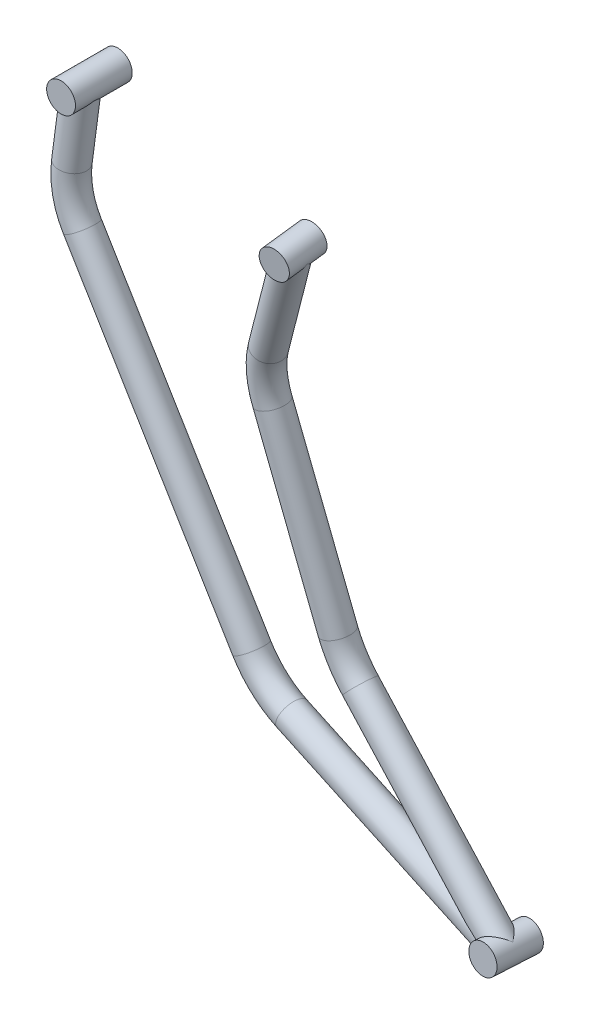
ISO-10303-21;
HEADER;
FILE_DESCRIPTION(('STEP AP214'),'2;1');
FILE_NAME('part.step','',(''),(''),'','','');
FILE_SCHEMA(('AUTOMOTIVE_DESIGN { 1 0 10303 214 1 1 1 1 }'));
ENDSEC;
DATA;
#1=APPLICATION_CONTEXT('core data for automotive mechanical design processes');
#2=APPLICATION_PROTOCOL_DEFINITION('international standard','automotive_design',2000,#1);
#3=PRODUCT_CONTEXT('',#1,'mechanical');
#4=PRODUCT('Part','Part','',(#3));
#5=PRODUCT_RELATED_PRODUCT_CATEGORY('part','',(#4));
#6=PRODUCT_DEFINITION_FORMATION('','',#4);
#7=PRODUCT_DEFINITION_CONTEXT('part definition',#1,'design');
#8=PRODUCT_DEFINITION('design','',#6,#7);
#9=PRODUCT_DEFINITION_SHAPE('','',#8);
#10=(LENGTH_UNIT() NAMED_UNIT(*) SI_UNIT(.MILLI.,.METRE.));
#11=(NAMED_UNIT(*) PLANE_ANGLE_UNIT() SI_UNIT($,.RADIAN.));
#12=(NAMED_UNIT(*) SI_UNIT($,.STERADIAN.) SOLID_ANGLE_UNIT());
#13=UNCERTAINTY_MEASURE_WITH_UNIT(LENGTH_MEASURE(1.E-05),#10,'distance_accuracy_value','');
#14=(GEOMETRIC_REPRESENTATION_CONTEXT(3) GLOBAL_UNCERTAINTY_ASSIGNED_CONTEXT((#13)) GLOBAL_UNIT_ASSIGNED_CONTEXT((#10,
#11,#12)) REPRESENTATION_CONTEXT('',''));
#15=CARTESIAN_POINT('',(0.,0.,0.));
#16=DIRECTION('',(0.,0.,1.));
#17=DIRECTION('',(1.,0.,0.));
#18=AXIS2_PLACEMENT_3D('',#15,#16,#17);
#19=CARTESIAN_POINT('',(231.586624275046,-513.969189947425,47.5737178485684));
#20=DIRECTION('',(-0.947717894379385,0.305407952619386,-0.092502838604765));
#21=DIRECTION('',(-0.30672305201049,-0.951798807188457,0.));
#22=AXIS2_PLACEMENT_3D('',#19,#20,#21);
#23=CYLINDRICAL_SURFACE('',#22,12.7);
#24=CARTESIAN_POINT('',(159.088704017285,-490.606286781409,40.4974945794316));
#25=DIRECTION('',(-0.635695409291388,0.186655783242306,-0.749033353855525));
#26=DIRECTION('',(-0.707461400161027,0.24735371750565,0.662053249911467));
#27=AXIS2_PLACEMENT_3D('',#24,#25,#26);
#28=ELLIPSE('',#27,17.4270106446501,12.7);
#29=CARTESIAN_POINT('',(147.371744516841,-484.767823419317,51.8964533482496));
#30=VERTEX_POINT('',#29);
#31=CARTESIAN_POINT('',(155.166280410253,-502.681147022815,40.8174058132266));
#32=VERTEX_POINT('',#31);
#33=EDGE_CURVE('E41',#30,#32,#28,.F.);
#34=ORIENTED_EDGE('',*,*,#33,.F.);
#35=CARTESIAN_POINT('',(159.088704017286,-490.606286781409,40.4974945794316));
#36=DIRECTION('',(-0.497787016235662,-0.864562053904488,-0.0688515897830283));
#37=DIRECTION('',(0.861113584556637,-0.50214131408708,0.0796083863604879));
#38=AXIS2_PLACEMENT_3D('',#35,#36,#37);
#39=ELLIPSE('',#38,59.3218151902676,12.7);
#40=CARTESIAN_POINT('',(148.987815870982,-483.726230349077,27.1333188016929));
#41=VERTEX_POINT('',#40);
#42=EDGE_CURVE('E36',#41,#30,#39,.F.);
#43=ORIENTED_EDGE('',*,*,#42,.F.);
#44=CARTESIAN_POINT('',(159.088704017285,-490.606286781409,40.4974945794316));
#45=DIRECTION('',(-0.707461400161027,0.24735371750565,0.662053249911467));
#46=DIRECTION('',(-0.635695409291388,0.186655783242306,-0.749033353855525));
#47=AXIS2_PLACEMENT_3D('',#44,#45,#46);
#48=ELLIPSE('',#47,18.5462157143354,12.7);
#49=EDGE_CURVE('E11',#32,#41,#48,.F.);
#50=ORIENTED_EDGE('',*,*,#49,.F.);
#51=EDGE_LOOP('',(#34,#43,#50));
#52=FACE_BOUND('',#51,.T.);
#53=CARTESIAN_POINT('',(-47.0551471450404,-424.17515584894,20.3766426819156));
#54=DIRECTION('',(-0.947717894379385,0.305407952619386,-0.092502838604765));
#55=DIRECTION('',(-0.310856444607048,-0.949067973620093,0.0513639201669528));
#56=AXIS2_PLACEMENT_3D('',#53,#54,#55);
#57=CIRCLE('',#56,12.7);
#58=CARTESIAN_POINT('',(-50.8287252722988,-436.243638071434,19.192647342898));
#59=VERTEX_POINT('',#58);
#60=EDGE_CURVE('E104',#59,#59,#57,.T.);
#61=ORIENTED_EDGE('',*,*,#60,.F.);
#62=EDGE_LOOP('',(#61));
#63=FACE_BOUND('',#62,.T.);
#64=ADVANCED_FACE('F33',(#52,#63),#23,.T.);
#65=CARTESIAN_POINT('',(-240.877210012418,-45.2006933707613,12.0115496007613));
#66=DIRECTION('',(0.104381548470398,0.9940550014184,-0.0309700903128577));
#67=DIRECTION('',(-0.994532066812263,0.104431643107478,0.));
#68=AXIS2_PLACEMENT_3D('',#65,#66,#67);
#69=PLANE('',#68);
#70=CARTESIAN_POINT('',(-239.863476334979,-45.2006933707613,15.4282361495826));
#71=DIRECTION('',(0.104381548470398,0.9940550014184,-0.0309700903128577));
#72=DIRECTION('',(-0.00323425741855784,-0.0308007479282089,-0.999520311702575));
#73=AXIS2_PLACEMENT_3D('',#70,#71,#72);
#74=ELLIPSE('',#73,410.073069587639,12.7);
#75=CARTESIAN_POINT('',(-252.518508395096,-44.1329089555214,7.0486866761965));
#76=VERTEX_POINT('',#75);
#77=CARTESIAN_POINT('',(-252.488960825152,-43.8269607226727,16.9683733493471));
#78=VERTEX_POINT('',#77);
#79=EDGE_CURVE('E102',#76,#78,#74,.T.);
#80=ORIENTED_EDGE('',*,*,#79,.F.);
#81=CARTESIAN_POINT('',(-240.877210012418,-45.2006933707613,12.0115496007613));
#82=DIRECTION('',(0.104381548470398,0.9940550014184,-0.0309700903128577));
#83=DIRECTION('',(-0.994532066812263,0.104431643107478,0.));
#84=AXIS2_PLACEMENT_3D('',#81,#82,#83);
#85=CIRCLE('',#84,12.7);
#86=CARTESIAN_POINT('',(-253.507767260934,-43.8744115032963,12.0115496007613));
#87=VERTEX_POINT('',#86);
#88=EDGE_CURVE('E162',#76,#87,#85,.T.);
#89=ORIENTED_EDGE('',*,*,#88,.T.);
#90=EDGE_CURVE('E158',#87,#78,#85,.T.);
#91=ORIENTED_EDGE('',*,*,#90,.T.);
#92=EDGE_LOOP('',(#80,#89,#91));
#93=FACE_BOUND('',#92,.T.);
#94=ADVANCED_FACE('F118',(#93),#69,.T.);
#95=CARTESIAN_POINT('',(-26.255897624718,-357.655962496609,26.9026012434299));
#96=DIRECTION('',(0.116375626427726,0.060868258360669,-0.991338372452965));
#97=DIRECTION('',(-0.993179918166434,0.,-0.116591809965008));
#98=AXIS2_PLACEMENT_3D('',#95,#96,#97);
#99=TOROIDAL_SURFACE('',#98,70.,12.7);
#100=CARTESIAN_POINT('',(-85.1251400696163,-394.403432402149,17.7354997655808));
#101=DIRECTION('',(-0.528388035844214,0.848945230998224,-0.00990345101797652));
#102=DIRECTION('',(-0.848976711255751,-0.528243945847918,0.0140313014503907));
#103=AXIS2_PLACEMENT_3D('',#100,#101,#102);
#104=CIRCLE('',#103,12.7);
#105=CARTESIAN_POINT('',(-95.8057026274764,-401.070473370726,16.0723256403139));
#106=VERTEX_POINT('',#105);
#107=EDGE_CURVE('E157',#106,#106,#104,.T.);
#108=CARTESIAN_POINT('',(-26.255897624718,-357.655962496609,26.9026012434299));
#109=DIRECTION('',(0.116375626427726,0.060868258360669,-0.991338372452965));
#110=DIRECTION('',(-0.993179918166434,0.,-0.116591809965008));
#111=AXIS2_PLACEMENT_3D('',#108,#109,#110);
#112=CIRCLE('',#111,82.7);
#113=EDGE_CURVE('',#59,#106,#112,.T.);
#114=ORIENTED_EDGE('',*,*,#60,.T.);
#115=ORIENTED_EDGE('',*,*,#107,.F.);
#116=ORIENTED_EDGE('',*,*,#113,.T.);
#117=ORIENTED_EDGE('',*,*,#113,.F.);
#118=EDGE_LOOP('',(#114,#116,#115,#117));
#119=FACE_BOUND('',#118,.T.);
#120=ADVANCED_FACE('F149',(#119),#99,.T.);
#121=CARTESIAN_POINT('',(-85.1251400696164,-394.403432402149,17.7354997655808));
#122=DIRECTION('',(-0.528388035844212,0.848945230998225,-0.00990345101797635));
#123=DIRECTION('',(-0.848986865631222,-0.528413949461663,0.));
#124=AXIS2_PLACEMENT_3D('',#121,#122,#123);
#125=CYLINDRICAL_SURFACE('',#124,12.7);
#126=CARTESIAN_POINT('',(-237.067860888196,-150.281613826645,14.8876735638375));
#127=DIRECTION('',(-0.528388035844212,0.848945230998225,-0.00990345101797635));
#128=DIRECTION('',(-0.848976711255752,-0.528243945847917,0.0140313014503907));
#129=AXIS2_PLACEMENT_3D('',#126,#127,#128);
#130=CIRCLE('',#129,12.7);
#131=CARTESIAN_POINT('',(-247.84483645808,-156.983676541388,15.3663727739619));
#132=VERTEX_POINT('',#131);
#133=EDGE_CURVE('E160',#132,#132,#130,.T.);
#134=ORIENTED_EDGE('',*,*,#133,.F.);
#135=EDGE_LOOP('',(#134));
#136=FACE_BOUND('',#135,.T.);
#137=ORIENTED_EDGE('',*,*,#107,.T.);
#138=EDGE_LOOP('',(#137));
#139=FACE_BOUND('',#138,.T.);
#140=ADVANCED_FACE('F216',(#136,#139),#125,.T.);
#141=CARTESIAN_POINT('',(-177.667208140804,-113.341110674517,12.2491739804745));
#142=DIRECTION('',(-0.0267729024962899,-0.0283203295335506,-0.999240296738995));
#143=DIRECTION('',(0.,0.999598611258079,-0.0283304848338224));
#144=AXIS2_PLACEMENT_3D('',#141,#142,#143);
#145=TOROIDAL_SURFACE('',#144,70.,12.7);
#146=CARTESIAN_POINT('',(-247.259590983692,-105.981912067206,13.905207225006));
#147=DIRECTION('',(0.104381548470398,0.9940550014184,-0.0309700903128577));
#148=DIRECTION('',(-0.994532066812263,0.104431643107478,0.));
#149=AXIS2_PLACEMENT_3D('',#146,#147,#148);
#150=CIRCLE('',#149,12.7);
#151=CARTESIAN_POINT('',(-259.885637585188,-104.646743177022,14.2056589707995));
#152=VERTEX_POINT('',#151);
#153=EDGE_CURVE('E170',#152,#152,#150,.T.);
#154=CARTESIAN_POINT('',(-177.667208140804,-113.341110674517,12.2491739804745));
#155=DIRECTION('',(-0.0267729024962899,-0.0283203295335506,-0.999240296738995));
#156=DIRECTION('',(0.,0.999598611258079,-0.0283304848338224));
#157=AXIS2_PLACEMENT_3D('',#154,#155,#156);
#158=CIRCLE('',#157,82.7);
#159=EDGE_CURVE('',#132,#152,#158,.T.);
#160=ORIENTED_EDGE('',*,*,#133,.T.);
#161=ORIENTED_EDGE('',*,*,#153,.F.);
#162=ORIENTED_EDGE('',*,*,#159,.T.);
#163=ORIENTED_EDGE('',*,*,#159,.F.);
#164=EDGE_LOOP('',(#160,#162,#161,#163));
#165=FACE_BOUND('',#164,.T.);
#166=ADVANCED_FACE('F219',(#165),#145,.T.);
#167=CARTESIAN_POINT('',(-247.259590983692,-105.981912067206,13.9052072250059));
#168=DIRECTION('',(0.104381548470399,0.9940550014184,-0.0309700903128577));
#169=DIRECTION('',(-0.994532066812263,0.104431643107478,0.));
#170=AXIS2_PLACEMENT_3D('',#167,#168,#169);
#171=CYLINDRICAL_SURFACE('',#170,12.7);
#172=CARTESIAN_POINT('',(-252.488960825152,-43.8269607226727,16.9683733493471));
#173=CARTESIAN_POINT('',(-252.498937800802,-43.9186348516954,16.9704014415881));
#174=CARTESIAN_POINT('',(-252.507903543102,-44.0103451560686,16.9748220255995));
#175=CARTESIAN_POINT('',(-252.523813866831,-44.1935699789422,16.9883238312775));
#176=CARTESIAN_POINT('',(-252.530759075104,-44.2850845494018,16.9974036050722));
#177=CARTESIAN_POINT('',(-252.548530424233,-44.5583450339385,17.0313658130275));
#178=CARTESIAN_POINT('',(-252.556365707998,-44.7394869096082,17.0629880166537));
#179=CARTESIAN_POINT('',(-252.564255114574,-45.0947771161732,17.1413488160857));
#180=CARTESIAN_POINT('',(-252.56445986878,-45.2689929127144,17.1877765072272));
#181=CARTESIAN_POINT('',(-252.557936393207,-45.6134809273562,17.2934428525688));
#182=CARTESIAN_POINT('',(-252.551201479711,-45.7837491818687,17.3526938136311));
#183=CARTESIAN_POINT('',(-252.525585548417,-46.2161437572249,17.5183357841652));
#184=CARTESIAN_POINT('',(-252.501959278479,-46.4750751640826,17.6322991811051));
#185=CARTESIAN_POINT('',(-252.440424733636,-46.9827837779426,17.877489116659));
#186=CARTESIAN_POINT('',(-252.402507795411,-47.2315547238499,18.0087260954335));
#187=CARTESIAN_POINT('',(-252.312984962842,-47.7231684341629,18.2842451772794));
#188=CARTESIAN_POINT('',(-252.261219903755,-47.9659039044561,18.4286652003215));
#189=CARTESIAN_POINT('',(-252.144905531717,-48.4436798721797,18.7249910474148));
#190=CARTESIAN_POINT('',(-252.080351632922,-48.6787175739981,18.8768995419748));
#191=CARTESIAN_POINT('',(-251.947141575625,-49.1148638308299,19.1670801999384));
#192=CARTESIAN_POINT('',(-251.879853713464,-49.3167195505873,19.3048630257566));
#193=CARTESIAN_POINT('',(-251.73571823165,-49.7156502825104,19.5823522041838));
#194=CARTESIAN_POINT('',(-251.658869482252,-49.9127247264121,19.7220587823713));
#195=CARTESIAN_POINT('',(-251.413926682555,-50.4974827917721,20.1422852884948));
#196=CARTESIAN_POINT('',(-251.231481306081,-50.8785537796994,20.4238116358269));
#197=CARTESIAN_POINT('',(-250.828656908626,-51.6219580515975,20.9802847451461));
#198=CARTESIAN_POINT('',(-250.608449157375,-51.984366726502,21.2552550928914));
#199=CARTESIAN_POINT('',(-250.128339127304,-52.6910106143337,21.7934215461538));
#200=CARTESIAN_POINT('',(-249.86846187673,-53.0352571031339,22.0566249412354));
#201=CARTESIAN_POINT('',(-249.395119892506,-53.5987712851449,22.4856899733312));
#202=CARTESIAN_POINT('',(-249.192458376988,-53.8235325598996,22.6563088073264));
#203=CARTESIAN_POINT('',(-248.767259557436,-54.2619224582402,22.9868618591154));
#204=CARTESIAN_POINT('',(-248.544723035153,-54.4755515191701,23.1467964967218));
#205=CARTESIAN_POINT('',(-248.079752063015,-54.8898468193557,23.4534916138062));
#206=CARTESIAN_POINT('',(-247.837333288188,-55.0905230516511,23.6002622841149));
#207=CARTESIAN_POINT('',(-247.332543762452,-55.4770751981291,23.8782032795007));
#208=CARTESIAN_POINT('',(-247.070177070392,-55.6629541074859,24.009376764322));
#209=CARTESIAN_POINT('',(-246.57868231069,-55.9833014197462,24.2297979806176));
#210=CARTESIAN_POINT('',(-246.352935877351,-56.1207611213069,24.322248244525));
#211=CARTESIAN_POINT('',(-245.889439330826,-56.3832091502846,24.4937374411482));
#212=CARTESIAN_POINT('',(-245.651691870877,-56.5082002162906,24.5727793215409));
#213=CARTESIAN_POINT('',(-245.165181192862,-56.7443060971024,24.7159653681068));
#214=CARTESIAN_POINT('',(-244.916422756678,-56.8554268569905,24.7801159271955));
#215=CARTESIAN_POINT('',(-244.409089494357,-57.0624998929698,24.8921766197767));
#216=CARTESIAN_POINT('',(-244.150514581039,-57.1584520343079,24.9400866089974));
#217=CARTESIAN_POINT('',(-243.623477088223,-57.3345342108841,25.0187189596031));
#218=CARTESIAN_POINT('',(-243.354959625749,-57.4145532822255,25.0493233374237));
#219=CARTESIAN_POINT('',(-242.811809386767,-57.5569121216483,25.0918958489654));
#220=CARTESIAN_POINT('',(-242.537176594319,-57.6192518436401,25.1038639341026));
#221=CARTESIAN_POINT('',(-241.984287748861,-57.7255239583634,25.1085967906525));
#222=CARTESIAN_POINT('',(-241.706032796098,-57.7694618121592,25.1013672639614));
#223=CARTESIAN_POINT('',(-241.148390699727,-57.8386487592369,25.0675871082203));
#224=CARTESIAN_POINT('',(-240.869003645175,-57.8638992949285,25.0410379706982));
#225=CARTESIAN_POINT('',(-240.341326949233,-57.8941525197513,24.9727849261028));
#226=CARTESIAN_POINT('',(-240.092891693726,-57.9010238353559,24.9329942103476));
#227=CARTESIAN_POINT('',(-239.598867578896,-57.9003385247802,24.8387507020593));
#228=CARTESIAN_POINT('',(-239.353278474886,-57.8927831482806,24.7842991798376));
#229=CARTESIAN_POINT('',(-238.866445312992,-57.8638448880047,24.6614292189039));
#230=CARTESIAN_POINT('',(-238.625201645281,-57.8424607688579,24.5930095327403));
#231=CARTESIAN_POINT('',(-238.148376179612,-57.7866404356516,24.4430512596));
#232=CARTESIAN_POINT('',(-237.912794733189,-57.7522034134253,24.3615118604999));
#233=CARTESIAN_POINT('',(-237.436068265672,-57.6690251917813,24.1816031587389));
#234=CARTESIAN_POINT('',(-237.195289391429,-57.6196230066109,24.0825712243812));
#235=CARTESIAN_POINT('',(-236.722101288473,-57.5084495115929,23.8720872753162));
#236=CARTESIAN_POINT('',(-236.489694793033,-57.4466742047859,23.7606312523582));
#237=CARTESIAN_POINT('',(-236.033995117793,-57.3119087141274,23.5264075771296));
#238=CARTESIAN_POINT('',(-235.810703121197,-57.2389170800442,23.4036384629388));
#239=CARTESIAN_POINT('',(-235.373734735475,-57.0828676654661,23.1478387488932));
#240=CARTESIAN_POINT('',(-235.16005939264,-56.9998087932704,23.0148070367221));
#241=CARTESIAN_POINT('',(-234.62474132214,-56.7752794717542,22.661661200394));
#242=CARTESIAN_POINT('',(-234.310246927732,-56.6273048624393,22.4347838543651));
#243=CARTESIAN_POINT('',(-233.706084366589,-56.3134107737108,21.9613936421906));
#244=CARTESIAN_POINT('',(-233.416420491732,-56.147488203213,21.7148773956719));
#245=CARTESIAN_POINT('',(-232.861098578638,-55.8008875760022,21.2039207203187));
#246=CARTESIAN_POINT('',(-232.595511815853,-55.6201685416205,20.9394308842621));
#247=CARTESIAN_POINT('',(-232.089093407994,-55.2479664352483,20.3949935763816));
#248=CARTESIAN_POINT('',(-231.848257178369,-55.0564853669152,20.1150489820698));
#249=CARTESIAN_POINT('',(-231.384553304144,-54.6607845572859,19.5326177939473));
#250=CARTESIAN_POINT('',(-231.162381734079,-54.4563579926713,19.2297186032239));
#251=CARTESIAN_POINT('',(-230.743607073277,-54.0440134435413,18.6087829879942));
#252=CARTESIAN_POINT('',(-230.547013781988,-53.836094155151,18.2907408253404));
#253=CARTESIAN_POINT('',(-230.180166886675,-53.4225955898921,17.6395504615704));
#254=CARTESIAN_POINT('',(-230.009855470741,-53.2170121258729,17.3064375622893));
#255=CARTESIAN_POINT('',(-229.696212272062,-52.815246860841,16.622556532012));
#256=CARTESIAN_POINT('',(-229.552857001628,-52.6190569870772,16.2718041118378));
#257=CARTESIAN_POINT('',(-229.311330388843,-52.2704553166827,15.5929544483699));
#258=CARTESIAN_POINT('',(-229.209776698392,-52.1156241638411,15.2673362808527));
#259=CARTESIAN_POINT('',(-229.03301573329,-51.8353330200042,14.5967354632745));
#260=CARTESIAN_POINT('',(-228.957771799152,-51.7098322422192,14.2517805411233));
#261=CARTESIAN_POINT('',(-228.850606410282,-51.5265227896996,13.6076056099583));
#262=CARTESIAN_POINT('',(-228.813232787116,-51.4604688724369,13.3117985883897));
#263=CARTESIAN_POINT('',(-228.77620827969,-51.3944853824578,12.862050021419));
#264=CARTESIAN_POINT('',(-228.767039175054,-51.3780071028817,12.7112515524839));
#265=CARTESIAN_POINT('',(-228.755327938899,-51.3569265869322,12.4085409860737));
#266=CARTESIAN_POINT('',(-228.752785474441,-51.3523237539044,12.2566289449319));
#267=CARTESIAN_POINT('',(-228.754481158764,-51.3553846312741,11.9524685886518));
#268=CARTESIAN_POINT('',(-228.758741677055,-51.3630888095191,11.8002208147826));
#269=CARTESIAN_POINT('',(-228.773984817816,-51.3904768706734,11.4971568887438));
#270=CARTESIAN_POINT('',(-228.784967737345,-51.4101612829826,11.3463408001388));
#271=CARTESIAN_POINT('',(-228.813377497291,-51.4605772035365,11.04689326998));
#272=CARTESIAN_POINT('',(-228.83081737006,-51.4913310501873,10.8982668832069));
#273=CARTESIAN_POINT('',(-228.871706361166,-51.5625072299875,10.6041674165791));
#274=CARTESIAN_POINT('',(-228.895158001625,-51.6029336205919,10.4586956880502));
#275=CARTESIAN_POINT('',(-228.962863146479,-51.7178461340226,10.0876336244937));
#276=CARTESIAN_POINT('',(-229.011279008311,-51.7984602440013,9.86469855404063));
#277=CARTESIAN_POINT('',(-229.120259046091,-51.9744659615267,9.42782346405119));
#278=CARTESIAN_POINT('',(-229.180832151971,-52.0698684198492,9.21389019721501));
#279=CARTESIAN_POINT('',(-229.313047489792,-52.2712676023909,8.79366232959568));
#280=CARTESIAN_POINT('',(-229.384728586297,-52.3773010438721,8.58739782866321));
#281=CARTESIAN_POINT('',(-229.538118819687,-52.5962922650289,8.18236578268698));
#282=CARTESIAN_POINT('',(-229.619831592787,-52.7092525480295,7.98360099041897));
#283=CARTESIAN_POINT('',(-229.789457815407,-52.935250269922,7.60008272757321));
#284=CARTESIAN_POINT('',(-229.877028328695,-53.0481290763178,7.41508304432938));
#285=CARTESIAN_POINT('',(-230.060560413024,-53.2762308593058,7.05076329331943));
#286=CARTESIAN_POINT('',(-230.156523323178,-53.3914542077405,6.87144413819487));
#287=CARTESIAN_POINT('',(-230.456776373514,-53.7386955767034,6.34114454647859));
#288=CARTESIAN_POINT('',(-230.673354817884,-53.9721815903716,5.99799197147772));
#289=CARTESIAN_POINT('',(-231.138199178797,-54.4347179205682,5.33127738989621));
#290=CARTESIAN_POINT('',(-231.386442619029,-54.6637712519365,5.00770172520278));
#291=CARTESIAN_POINT('',(-231.914596216322,-55.1115504215963,4.38001846073791));
#292=CARTESIAN_POINT('',(-232.194490439935,-55.330281378403,4.07590118501753));
#293=CARTESIAN_POINT('',(-232.72572944523,-55.7090830859828,3.54837419265036));
#294=CARTESIAN_POINT('',(-232.971256928297,-55.8720202005109,3.32115288999873));
#295=CARTESIAN_POINT('',(-233.482485437532,-56.1853562025982,2.8810906196292));
#296=CARTESIAN_POINT('',(-233.748186994709,-56.335754759906,2.668250030711));
#297=CARTESIAN_POINT('',(-234.29909971093,-56.6210172177969,2.25895445793444));
#298=CARTESIAN_POINT('',(-234.584280289117,-56.7559046153141,2.06247481781852));
#299=CARTESIAN_POINT('',(-235.173923475962,-57.0075035563284,1.68762721046261));
#300=CARTESIAN_POINT('',(-235.478381262598,-57.1242196201529,1.50925474271034));
#301=CARTESIAN_POINT('',(-236.038722478697,-57.313875115009,1.20880775774872));
#302=CARTESIAN_POINT('',(-236.291156196173,-57.390844911625,1.0828302616717));
#303=CARTESIAN_POINT('',(-236.806423492316,-57.5301546712021,0.844874729511588));
#304=CARTESIAN_POINT('',(-237.069254715896,-57.5924979252266,0.732893546825428));
#305=CARTESIAN_POINT('',(-237.604111497605,-57.7010816474714,0.524264575969847));
#306=CARTESIAN_POINT('',(-237.876134428536,-57.7473266749272,0.427612450632502));
#307=CARTESIAN_POINT('',(-238.427907538196,-57.822367167347,0.250900143140068));
#308=CARTESIAN_POINT('',(-238.70765781168,-57.8511624182398,0.170840164542951));
#309=CARTESIAN_POINT('',(-239.274970677327,-57.8902585978236,0.0279848895322175));
#310=CARTESIAN_POINT('',(-239.56257480132,-57.9004259425496,-0.0346829908412926));
#311=CARTESIAN_POINT('',(-240.141317768561,-57.9009503310966,-0.141017042212809));
#312=CARTESIAN_POINT('',(-240.432456623115,-57.8913073115374,-0.184683152417174));
#313=CARTESIAN_POINT('',(-241.015520938273,-57.8517067127721,-0.252365855748183));
#314=CARTESIAN_POINT('',(-241.307446015002,-57.8217577096101,-0.276390734722124));
#315=CARTESIAN_POINT('',(-241.889434537972,-57.7414970168358,-0.304604801879113));
#316=CARTESIAN_POINT('',(-242.179498155492,-57.6911872287982,-0.308795841959367));
#317=CARTESIAN_POINT('',(-242.722481239792,-57.5774509349042,-0.298229366405374));
#318=CARTESIAN_POINT('',(-242.975892546446,-57.5161504253512,-0.285560552356487));
#319=CARTESIAN_POINT('',(-243.477338070928,-57.3784432310728,-0.245282399255233));
#320=CARTESIAN_POINT('',(-243.725372777986,-57.3020379272254,-0.217674425538211));
#321=CARTESIAN_POINT('',(-244.214512911,-57.1349002169504,-0.148207549457767));
#322=CARTESIAN_POINT('',(-244.455618063762,-57.0441672465753,-0.106348086070309));
#323=CARTESIAN_POINT('',(-244.929575138481,-56.8493115648698,-0.00925261813169551));
#324=CARTESIAN_POINT('',(-245.162426608286,-56.7451881214267,0.0459841179563051));
#325=CARTESIAN_POINT('',(-245.625649111973,-56.5212727485712,0.170675059674962));
#326=CARTESIAN_POINT('',(-245.855736289556,-56.4011045461875,0.240505994731522));
#327=CARTESIAN_POINT('',(-246.305223229228,-56.1487691346974,0.392148190681371));
#328=CARTESIAN_POINT('',(-246.524618827065,-56.0165973068073,0.473964070656272));
#329=CARTESIAN_POINT('',(-246.95204737169,-55.7414131828099,0.64836312546363));
#330=CARTESIAN_POINT('',(-247.160079178891,-55.598399802908,0.740947377270778));
#331=CARTESIAN_POINT('',(-247.564402360028,-55.3025998089927,0.935693751124074));
#332=CARTESIAN_POINT('',(-247.760691251167,-55.1498111422285,1.03785788699895));
#333=CARTESIAN_POINT('',(-248.23653749782,-54.7567889450754,1.30384068500499));
#334=CARTESIAN_POINT('',(-248.50863196337,-54.5110445472715,1.47293665013869));
#335=CARTESIAN_POINT('',(-249.025781830037,-54.0026123011779,1.82639898790301));
#336=CARTESIAN_POINT('',(-249.270825567343,-53.7399172208005,2.0107718881688));
#337=CARTESIAN_POINT('',(-249.734582009623,-53.1993405122088,2.3916675343743));
#338=CARTESIAN_POINT('',(-249.953239786542,-52.9214288970281,2.58821437917383));
#339=CARTESIAN_POINT('',(-250.364105456277,-52.3526083712604,2.98971453155809));
#340=CARTESIAN_POINT('',(-250.556317676987,-52.0617015977176,3.19466645648265));
#341=CARTESIAN_POINT('',(-250.918904324036,-51.4611501131111,3.61426058855542));
#342=CARTESIAN_POINT('',(-251.088691605155,-51.1512313509867,3.8290170464379));
#343=CARTESIAN_POINT('',(-251.401702620485,-50.5189498504917,4.25978577518586));
#344=CARTESIAN_POINT('',(-251.544917134121,-50.1965828393628,4.47579845523713));
#345=CARTESIAN_POINT('',(-251.80484295046,-49.5387725037517,4.90402811236275));
#346=CARTESIAN_POINT('',(-251.921553723052,-49.2033289178776,5.11624501343826));
#347=CARTESIAN_POINT('',(-252.076272795782,-48.6891798054727,5.42614666108188));
#348=CARTESIAN_POINT('',(-252.12444566911,-48.5160083080523,5.52802021109358));
#349=CARTESIAN_POINT('',(-252.213863373043,-48.165596384982,5.72770511805239));
#350=CARTESIAN_POINT('',(-252.25510940081,-47.9883566684715,5.82551717474103));
#351=CARTESIAN_POINT('',(-252.33004266487,-47.6312602842463,6.01451748766258));
#352=CARTESIAN_POINT('',(-252.363804735989,-47.4514506493028,6.10576452018796));
#353=CARTESIAN_POINT('',(-252.423960874352,-47.087043146503,6.28073839024106));
#354=CARTESIAN_POINT('',(-252.450357599214,-46.9024470320832,6.36446793286768));
#355=CARTESIAN_POINT('',(-252.495179779466,-46.5292840454065,6.5213883676417));
#356=CARTESIAN_POINT('',(-252.513656530224,-46.3407512824199,6.59464496319713));
#357=CARTESIAN_POINT('',(-252.542292779232,-45.958510400135,6.72814678738454));
#358=CARTESIAN_POINT('',(-252.552456687604,-45.7648050813787,6.78839890263772));
#359=CARTESIAN_POINT('',(-252.561522271206,-45.4521786950824,6.87129211343396));
#360=CARTESIAN_POINT('',(-252.563318257272,-45.3347490694036,6.89928192590197));
#361=CARTESIAN_POINT('',(-252.563614395236,-45.0985263775668,6.94865266455249));
#362=CARTESIAN_POINT('',(-252.562115645502,-44.9797337789177,6.97003579050122));
#363=CARTESIAN_POINT('',(-252.555686082432,-44.7399013925066,7.0056933549198));
#364=CARTESIAN_POINT('',(-252.550719762957,-44.6188510809331,7.01989160624937));
#365=CARTESIAN_POINT('',(-252.537267877489,-44.3761554188234,7.04036695635476));
#366=CARTESIAN_POINT('',(-252.528778671018,-44.2545095817624,7.04663583387404));
#367=CARTESIAN_POINT('',(-252.518508395095,-44.1329089555206,7.04868667619348));
#368=B_SPLINE_CURVE_WITH_KNOTS('',3,(#172,#173,#174,#175,#176,#177,#178,#179,#180,#181,#182,
#183,#184,#185,#186,#187,#188,#189,#190,#191,#192,#193,#194,#195,#196,#197,#198,#199,#200,#201,
#202,#203,#204,#205,#206,#207,#208,#209,#210,#211,#212,#213,#214,#215,#216,#217,#218,#219,#220,
#221,#222,#223,#224,#225,#226,#227,#228,#229,#230,#231,#232,#233,#234,#235,#236,#237,#238,#239,
#240,#241,#242,#243,#244,#245,#246,#247,#248,#249,#250,#251,#252,#253,#254,#255,#256,#257,#258,
#259,#260,#261,#262,#263,#264,#265,#266,#267,#268,#269,#270,#271,#272,#273,#274,#275,#276,#277,
#278,#279,#280,#281,#282,#283,#284,#285,#286,#287,#288,#289,#290,#291,#292,#293,#294,#295,#296,
#297,#298,#299,#300,#301,#302,#303,#304,#305,#306,#307,#308,#309,#310,#311,#312,#313,#314,#315,
#316,#317,#318,#319,#320,#321,#322,#323,#324,#325,#326,#327,#328,#329,#330,#331,#332,#333,#334,
#335,#336,#337,#338,#339,#340,#341,#342,#343,#344,#345,#346,#347,#348,#349,#350,#351,#352,#353,
#354,#355,#356,#357,#358,#359,#360,#361,#362,#363,#364,#365,#366,#367),.UNSPECIFIED.,.F.,.F.,(4,
2,2,2,2,2,2,2,2,2,2,2,2,2,2,2,2,2,2,2,2,2,2,2,2,2,2,2,2,2,2,2,2,2,2,2,2,2,2,2,2,2,2,2,2,2,2,2,2,
2,2,2,2,2,2,2,2,2,2,2,2,2,2,2,2,2,2,2,2,2,2,2,2,2,2,2,2,2,2,2,2,2,2,2,2,2,2,2,2,2,2,2,2,2,2,2,2,
4),(0.,0.276638589570993,0.553191264012432,1.1042576955364,1.64443984838868,2.18514274697867,
3.03527829173954,3.88593003872046,4.74681339349525,5.6080060058979,6.36823060468965,
7.12854511937868,8.64972424767334,10.1641782758254,11.6776807253686,12.719147861598,
13.760574051502,14.8011869385612,15.8415886533642,16.6808294966471,17.5198856028286,
18.3585808292609,19.1972835059773,20.0416372759126,20.8859932470338,21.7300984634438,
22.5741385194859,23.3283661366283,24.0825284234104,24.8367580914773,25.5910344650814,
26.3852590259183,27.1797405645854,27.9743249134886,28.7689955050899,30.0122939194565,
31.2558068026094,32.5028882173732,33.7497382168009,35.0316638977767,36.314079267865,
37.59363223043,38.8720650611545,39.9940747462191,41.1145147564086,42.0267481431337,
42.4821308163499,42.9374906094731,43.3943507988137,43.8512311780174,44.3090387710635,
44.7670387437461,45.4916436069382,46.2167826792581,46.9445186644619,47.6725192176774,
48.3734859731157,49.0745647814973,50.477359220925,51.8791634188245,53.2802650443616,
54.3956514606781,55.5110672457358,56.624770452504,57.7381961686437,58.6146942740531,
59.4909949723729,60.3670472881806,61.2431103510531,62.1254315873035,63.0077556464027,
63.8897072960385,64.771576595705,65.5537441963481,66.3358403243803,67.1179672439635,
67.900136943859,68.7057658813689,69.5117061348284,70.317727062028,71.1239178078404,
72.3333814693842,73.5433646106299,74.7558246602833,75.9680860505636,77.2075631585426,
78.4474695558173,79.687400750691,80.3070739383896,80.9266399178413,81.5396990760111,
82.1525367388982,82.7613429511099,83.3698259700274,83.731824849928,84.0937030682531,
84.4593421366873,84.8253599935632),.UNSPECIFIED.);
#369=EDGE_CURVE('E93',#78,#76,#368,.T.);
#370=ORIENTED_EDGE('',*,*,#369,.F.);
#371=ORIENTED_EDGE('',*,*,#90,.F.);
#372=ORIENTED_EDGE('',*,*,#88,.F.);
#373=EDGE_LOOP('',(#370,#371,#372));
#374=FACE_BOUND('',#373,.T.);
#375=ORIENTED_EDGE('',*,*,#153,.T.);
#376=EDGE_LOOP('',(#375));
#377=FACE_BOUND('',#376,.T.);
#378=ADVANCED_FACE('F106',(#374,#377),#171,.T.);
#379=CARTESIAN_POINT('',(-9.9280005189577,-34.6675273844905,56.5568839646889));
#380=DIRECTION('',(-0.336857465880867,-0.932279780984455,-0.131838756243742));
#381=DIRECTION('',(0.940489146171812,-0.33982372773692,0.));
#382=AXIS2_PLACEMENT_3D('',#379,#380,#381);
#383=CYLINDRICAL_SURFACE('',#382,12.7);
#384=CARTESIAN_POINT('',(-9.92800051895774,-34.6675273844904,56.5568839646889));
#385=DIRECTION('',(-0.262052285997851,-0.583880328635586,-0.768382952202677));
#386=DIRECTION('',(-0.21278638637612,-0.741653391105117,0.636138507901599));
#387=AXIS2_PLACEMENT_3D('',#384,#385,#386);
#388=ELLIPSE('',#387,17.3044150557194,12.7);
#389=CARTESIAN_POINT('',(-21.8825433258494,-30.4739495136099,57.4472832678426));
#390=VERTEX_POINT('',#389);
#391=CARTESIAN_POINT('',(2.02654228793389,-38.861105255371,55.6664846615351));
#392=VERTEX_POINT('',#391);
#393=EDGE_CURVE('E76',#390,#392,#388,.F.);
#394=ORIENTED_EDGE('',*,*,#393,.F.);
#395=CARTESIAN_POINT('',(-9.92800051895774,-34.6675273844904,56.5568839646889));
#396=DIRECTION('',(-0.21278638637612,-0.741653391105117,0.636138507901599));
#397=DIRECTION('',(-0.262052285997851,-0.583880328635586,-0.768382952202677));
#398=AXIS2_PLACEMENT_3D('',#395,#396,#397);
#399=ELLIPSE('',#398,18.6973832199875,12.7);
#400=EDGE_CURVE('E80',#392,#390,#399,.F.);
#401=ORIENTED_EDGE('',*,*,#400,.F.);
#402=EDGE_LOOP('',(#394,#401));
#403=FACE_BOUND('',#402,.T.);
#404=CARTESIAN_POINT('',(-45.2638410991022,-132.462271612037,42.7271970948097));
#405=DIRECTION('',(-0.336857465880867,-0.932279780984455,-0.131838756243742));
#406=DIRECTION('',(0.927741739855121,-0.352542683732675,0.122510898605619));
#407=AXIS2_PLACEMENT_3D('',#404,#405,#406);
#408=CIRCLE('',#407,12.7);
#409=CARTESIAN_POINT('',(-57.1277918709416,-128.037251197726,41.749512883879));
#410=VERTEX_POINT('',#409);
#411=EDGE_CURVE('E172',#410,#410,#408,.T.);
#412=ORIENTED_EDGE('',*,*,#411,.F.);
#413=EDGE_LOOP('',(#412));
#414=FACE_BOUND('',#413,.T.);
#415=ADVANCED_FACE('F78',(#403,#414),#383,.T.);
#416=CARTESIAN_POINT('',(20.1280135488316,-156.852147911388,48.1160077062385));
#417=DIRECTION('',(-0.117705859040496,-0.09722742426539,0.988277369324147));
#418=DIRECTION('',(0.992981928472414,0.,0.118266181671714));
#419=AXIS2_PLACEMENT_3D('',#416,#417,#418);
#420=TOROIDAL_SURFACE('',#419,70.,12.7);
#421=CARTESIAN_POINT('',(-46.2684484361873,-176.70819238332,38.2546014271833));
#422=DIRECTION('',(0.294029693257878,-0.953983801148697,-0.0588340601060459));
#423=DIRECTION('',(0.942077981371661,0.278868398869345,0.186337041746253));
#424=AXIS2_PLACEMENT_3D('',#421,#422,#423);
#425=CIRCLE('',#424,12.7);
#426=CARTESIAN_POINT('',(-58.3146636820407,-180.310646166084,36.4654605736976));
#427=VERTEX_POINT('',#426);
#428=EDGE_CURVE('E175',#427,#427,#425,.T.);
#429=CARTESIAN_POINT('',(20.1280135488316,-156.852147911388,48.1160077062385));
#430=DIRECTION('',(-0.117705859040496,-0.09722742426539,0.988277369324147));
#431=DIRECTION('',(0.992981928472414,0.,0.118266181671714));
#432=AXIS2_PLACEMENT_3D('',#429,#430,#431);
#433=CIRCLE('',#432,82.6999999999999);
#434=EDGE_CURVE('',#410,#427,#433,.T.);
#435=ORIENTED_EDGE('',*,*,#411,.T.);
#436=ORIENTED_EDGE('',*,*,#428,.F.);
#437=ORIENTED_EDGE('',*,*,#434,.T.);
#438=ORIENTED_EDGE('',*,*,#434,.F.);
#439=EDGE_LOOP('',(#435,#437,#436,#438));
#440=FACE_BOUND('',#439,.T.);
#441=ADVANCED_FACE('F238',(#440),#420,.T.);
#442=CARTESIAN_POINT('',(-46.2684484361873,-176.70819238332,38.2546014271833));
#443=DIRECTION('',(0.29402969325788,-0.953983801148696,-0.0588340601060459));
#444=DIRECTION('',(0.955639181905679,0.294539902231674,0.));
#445=AXIS2_PLACEMENT_3D('',#442,#443,#444);
#446=CYLINDRICAL_SURFACE('',#445,12.7);
#447=CARTESIAN_POINT('',(1.79664573204982,-332.656119713805,28.636985573615));
#448=DIRECTION('',(0.294029693257879,-0.953983801148696,-0.0588340601060459));
#449=DIRECTION('',(0.94207798137166,0.278868398869346,0.186337041746254));
#450=AXIS2_PLACEMENT_3D('',#447,#448,#449);
#451=CIRCLE('',#450,12.7);
#452=CARTESIAN_POINT('',(-10.0901709026167,-336.147501857668,25.843449996728));
#453=VERTEX_POINT('',#452);
#454=EDGE_CURVE('E178',#453,#453,#451,.T.);
#455=ORIENTED_EDGE('',*,*,#454,.F.);
#456=EDGE_LOOP('',(#455));
#457=FACE_BOUND('',#456,.T.);
#458=ORIENTED_EDGE('',*,*,#428,.T.);
#459=EDGE_LOOP('',(#458));
#460=FACE_BOUND('',#459,.T.);
#461=ADVANCED_FACE('F142',(#457,#460),#446,.T.);
#462=CARTESIAN_POINT('',(67.3145326947784,-313.412281125587,44.0344257611814));
#463=DIRECTION('',(-0.193667362313199,-0.119742684498471,0.97373232578761));
#464=DIRECTION('',(0.980789142450354,0.,0.195070905189622));
#465=AXIS2_PLACEMENT_3D('',#462,#463,#464);
#466=TOROIDAL_SURFACE('',#465,70.,12.7);
#467=CARTESIAN_POINT('',(21.7937126022763,-364.33648603983,28.7184115290697));
#468=DIRECTION('',(0.734578930714291,-0.675590087113086,0.0630224463598589));
#469=DIRECTION('',(0.656574672288072,0.731177203843489,0.185174502265915));
#470=AXIS2_PLACEMENT_3D('',#467,#468,#469);
#471=CIRCLE('',#470,12.7);
#472=CARTESIAN_POINT('',(13.5349352426367,-373.575591788556,25.939648946958));
#473=VERTEX_POINT('',#472);
#474=EDGE_CURVE('E103',#473,#473,#471,.T.);
#475=CARTESIAN_POINT('',(67.3145326947784,-313.412281125587,44.0344257611814));
#476=DIRECTION('',(-0.193667362313199,-0.119742684498471,0.97373232578761));
#477=DIRECTION('',(0.980789142450354,0.,0.195070905189622));
#478=AXIS2_PLACEMENT_3D('',#475,#476,#477);
#479=CIRCLE('',#478,82.7);
#480=EDGE_CURVE('',#453,#473,#479,.T.);
#481=ORIENTED_EDGE('',*,*,#454,.T.);
#482=ORIENTED_EDGE('',*,*,#474,.F.);
#483=ORIENTED_EDGE('',*,*,#480,.T.);
#484=ORIENTED_EDGE('',*,*,#480,.F.);
#485=EDGE_LOOP('',(#481,#483,#482,#484));
#486=FACE_BOUND('',#485,.T.);
#487=ADVANCED_FACE('F119',(#486),#466,.T.);
#488=CARTESIAN_POINT('',(21.7937126022763,-364.33648603983,28.7184115290697));
#489=DIRECTION('',(0.734578930714292,-0.675590087113085,0.0630224463598589));
#490=DIRECTION('',(0.676935761096447,0.736042101614286,0.));
#491=AXIS2_PLACEMENT_3D('',#488,#489,#490);
#492=CYLINDRICAL_SURFACE('',#491,12.7);
#493=CARTESIAN_POINT('',(159.088704017285,-490.606286781409,40.4974945794316));
#494=DIRECTION('',(0.541180515826752,-0.507654075788944,-0.670381226336451));
#495=DIRECTION('',(0.498284936048024,-0.44858330840632,0.74194685653816));
#496=AXIS2_PLACEMENT_3D('',#493,#494,#495);
#497=ELLIPSE('',#496,18.1881508077646,12.7);
#498=CARTESIAN_POINT('',(167.691356028913,-481.264572558726,40.3680583072606));
#499=VERTEX_POINT('',#498);
#500=EDGE_CURVE('E49',#41,#499,#497,.T.);
#501=ORIENTED_EDGE('',*,*,#500,.F.);
#502=ORIENTED_EDGE('',*,*,#42,.T.);
#503=CARTESIAN_POINT('',(159.088704017285,-490.606286781409,40.4974945794316));
#504=DIRECTION('',(0.498284936048024,-0.44858330840632,0.74194685653816));
#505=DIRECTION('',(0.541180515826752,-0.507654075788944,-0.670381226336451));
#506=AXIS2_PLACEMENT_3D('',#503,#504,#505);
#507=ELLIPSE('',#506,17.7412123689661,12.7);
#508=EDGE_CURVE('E190',#499,#30,#507,.T.);
#509=ORIENTED_EDGE('',*,*,#508,.F.);
#510=EDGE_LOOP('',(#501,#502,#509));
#511=FACE_BOUND('',#510,.T.);
#512=ORIENTED_EDGE('',*,*,#474,.T.);
#513=EDGE_LOOP('',(#512));
#514=FACE_BOUND('',#513,.T.);
#515=ADVANCED_FACE('F116',(#511,#514),#492,.T.);
#516=CARTESIAN_POINT('',(-239.863476334979,-45.2006933707613,30.8700053408893));
#517=DIRECTION('',(0.,0.,-1.));
#518=DIRECTION('',(-1.,0.,0.));
#519=AXIS2_PLACEMENT_3D('',#516,#517,#518);
#520=CYLINDRICAL_SURFACE('',#519,12.7);
#521=ORIENTED_EDGE('',*,*,#369,.T.);
#522=ORIENTED_EDGE('',*,*,#79,.T.);
#523=EDGE_LOOP('',(#521,#522));
#524=FACE_BOUND('',#523,.T.);
#525=CARTESIAN_POINT('',(-239.863476334979,-45.2006933707613,30.8700053408893));
#526=DIRECTION('',(0.,0.,-1.));
#527=DIRECTION('',(-1.,0.,0.));
#528=AXIS2_PLACEMENT_3D('',#525,#526,#527);
#529=CIRCLE('',#528,12.7);
#530=CARTESIAN_POINT('',(-252.563476334979,-45.2006933707613,30.8700053408893));
#531=VERTEX_POINT('',#530);
#532=EDGE_CURVE('E89',#531,#531,#529,.T.);
#533=ORIENTED_EDGE('',*,*,#532,.T.);
#534=EDGE_LOOP('',(#533));
#535=FACE_BOUND('',#534,.T.);
#536=CARTESIAN_POINT('',(-239.863476334979,-45.2006933707613,-19.1299946591107));
#537=DIRECTION('',(0.,0.,-1.));
#538=DIRECTION('',(-1.,0.,0.));
#539=AXIS2_PLACEMENT_3D('',#536,#537,#538);
#540=CIRCLE('',#539,12.7);
#541=CARTESIAN_POINT('',(-252.563476334979,-45.2006933707613,-19.1299946591107));
#542=VERTEX_POINT('',#541);
#543=EDGE_CURVE('E86',#542,#542,#540,.T.);
#544=ORIENTED_EDGE('',*,*,#543,.F.);
#545=EDGE_LOOP('',(#544));
#546=FACE_BOUND('',#545,.T.);
#547=ADVANCED_FACE('F110',(#524,#535,#546),#520,.T.);
#548=CARTESIAN_POINT('',(-239.863476334979,-45.2006933707613,30.8700053408893));
#549=DIRECTION('',(0.,0.,-1.));
#550=DIRECTION('',(-1.,0.,0.));
#551=AXIS2_PLACEMENT_3D('',#548,#549,#550);
#552=PLANE('',#551);
#553=ORIENTED_EDGE('',*,*,#532,.F.);
#554=EDGE_LOOP('',(#553));
#555=FACE_BOUND('',#554,.T.);
#556=ADVANCED_FACE('F115',(#555),#552,.F.);
#557=CARTESIAN_POINT('',(-239.863476334979,-45.2006933707613,-19.1299946591107));
#558=DIRECTION('',(0.,0.,-1.));
#559=DIRECTION('',(-1.,0.,0.));
#560=AXIS2_PLACEMENT_3D('',#557,#558,#559);
#561=PLANE('',#560);
#562=ORIENTED_EDGE('',*,*,#543,.T.);
#563=EDGE_LOOP('',(#562));
#564=FACE_BOUND('',#563,.T.);
#565=ADVANCED_FACE('F121',(#564),#561,.T.);
#566=CARTESIAN_POINT('',(-9.10277337482806,-35.9667217386628,73.7553317389612));
#567=DIRECTION('',(-0.0477916564912546,0.0752406785594305,-0.996019476646787));
#568=DIRECTION('',(0.,0.997158904267472,0.0753267524860552));
#569=AXIS2_PLACEMENT_3D('',#566,#567,#568);
#570=CYLINDRICAL_SURFACE('',#569,12.7);
#571=ORIENTED_EDGE('',*,*,#400,.T.);
#572=ORIENTED_EDGE('',*,*,#393,.T.);
#573=EDGE_LOOP('',(#571,#572));
#574=FACE_BOUND('',#573,.T.);
#575=CARTESIAN_POINT('',(-9.10277337482806,-35.9667217386628,73.7553317389612));
#576=DIRECTION('',(-0.0477916564912546,0.0752406785594305,-0.996019476646786));
#577=DIRECTION('',(0.,0.997158904267472,0.0753267524860552));
#578=AXIS2_PLACEMENT_3D('',#575,#576,#577);
#579=CIRCLE('',#578,12.7);
#580=CARTESIAN_POINT('',(-9.10277337482806,-23.3028036544659,74.7119814955341));
#581=VERTEX_POINT('',#580);
#582=EDGE_CURVE('E82',#581,#581,#579,.T.);
#583=ORIENTED_EDGE('',*,*,#582,.T.);
#584=EDGE_LOOP('',(#583));
#585=FACE_BOUND('',#584,.T.);
#586=CARTESIAN_POINT('',(-10.775481352022,-33.3332979890827,38.8946500563236));
#587=DIRECTION('',(-0.0477916564912546,0.0752406785594305,-0.996019476646786));
#588=DIRECTION('',(0.,0.997158904267472,0.0753267524860552));
#589=AXIS2_PLACEMENT_3D('',#586,#587,#588);
#590=CIRCLE('',#589,12.7);
#591=CARTESIAN_POINT('',(-10.775481352022,-20.6693799048858,39.8512998128965));
#592=VERTEX_POINT('',#591);
#593=EDGE_CURVE('E186',#592,#592,#590,.T.);
#594=ORIENTED_EDGE('',*,*,#593,.F.);
#595=EDGE_LOOP('',(#594));
#596=FACE_BOUND('',#595,.T.);
#597=ADVANCED_FACE('F84',(#574,#585,#596),#570,.T.);
#598=CARTESIAN_POINT('',(-9.10277337482806,-35.9667217386628,73.7553317389612));
#599=DIRECTION('',(-0.0477916564912546,0.0752406785594305,-0.996019476646786));
#600=DIRECTION('',(0.,0.997158904267472,0.0753267524860552));
#601=AXIS2_PLACEMENT_3D('',#598,#599,#600);
#602=PLANE('',#601);
#603=ORIENTED_EDGE('',*,*,#582,.F.);
#604=EDGE_LOOP('',(#603));
#605=FACE_BOUND('',#604,.T.);
#606=ADVANCED_FACE('F130',(#605),#602,.F.);
#607=CARTESIAN_POINT('',(-10.775481352022,-33.3332979890827,38.8946500563236));
#608=DIRECTION('',(-0.0477916564912546,0.0752406785594305,-0.996019476646786));
#609=DIRECTION('',(0.,0.997158904267472,0.0753267524860552));
#610=AXIS2_PLACEMENT_3D('',#607,#608,#609);
#611=PLANE('',#610);
#612=ORIENTED_EDGE('',*,*,#593,.T.);
#613=EDGE_LOOP('',(#612));
#614=FACE_BOUND('',#613,.T.);
#615=ADVANCED_FACE('F131',(#614),#611,.T.);
#616=CARTESIAN_POINT('',(158.723227908027,-490.03090035464,57.7340214242879));
#617=DIRECTION('',(0.021187020826603,-0.0333557348851862,-0.999218947527899));
#618=DIRECTION('',(0.,0.999443292682912,-0.0333632239320382));
#619=AXIS2_PLACEMENT_3D('',#616,#617,#618);
#620=CYLINDRICAL_SURFACE('',#619,12.7);
#621=ORIENTED_EDGE('',*,*,#508,.T.);
#622=ORIENTED_EDGE('',*,*,#33,.T.);
#623=ORIENTED_EDGE('',*,*,#49,.T.);
#624=ORIENTED_EDGE('',*,*,#500,.T.);
#625=EDGE_LOOP('',(#621,#622,#623,#624));
#626=FACE_BOUND('',#625,.T.);
#627=CARTESIAN_POINT('',(158.723227908027,-490.03090035464,57.7340214242879));
#628=DIRECTION('',(0.021187020826603,-0.0333557348851862,-0.999218947527899));
#629=DIRECTION('',(0.,0.999443292682912,-0.0333632239320382));
#630=AXIS2_PLACEMENT_3D('',#627,#628,#629);
#631=CIRCLE('',#630,12.7);
#632=CARTESIAN_POINT('',(158.723227908027,-477.337970537567,57.310308480351));
#633=VERTEX_POINT('',#632);
#634=EDGE_CURVE('E167',#633,#633,#631,.T.);
#635=ORIENTED_EDGE('',*,*,#634,.T.);
#636=EDGE_LOOP('',(#635));
#637=FACE_BOUND('',#636,.T.);
#638=CARTESIAN_POINT('',(159.570708741091,-491.365129750047,17.7652635231719));
#639=DIRECTION('',(0.021187020826603,-0.0333557348851862,-0.999218947527899));
#640=DIRECTION('',(0.,0.999443292682912,-0.0333632239320382));
#641=AXIS2_PLACEMENT_3D('',#638,#639,#640);
#642=CIRCLE('',#641,12.7);
#643=CARTESIAN_POINT('',(159.570708741091,-478.672199932974,17.341550579235));
#644=VERTEX_POINT('',#643);
#645=EDGE_CURVE('E194',#644,#644,#642,.T.);
#646=ORIENTED_EDGE('',*,*,#645,.F.);
#647=EDGE_LOOP('',(#646));
#648=FACE_BOUND('',#647,.T.);
#649=ADVANCED_FACE('F134',(#626,#637,#648),#620,.T.);
#650=CARTESIAN_POINT('',(158.723227908027,-490.03090035464,57.7340214242879));
#651=DIRECTION('',(0.021187020826603,-0.0333557348851862,-0.999218947527899));
#652=DIRECTION('',(0.,0.999443292682912,-0.0333632239320382));
#653=AXIS2_PLACEMENT_3D('',#650,#651,#652);
#654=PLANE('',#653);
#655=ORIENTED_EDGE('',*,*,#634,.F.);
#656=EDGE_LOOP('',(#655));
#657=FACE_BOUND('',#656,.T.);
#658=ADVANCED_FACE('F202',(#657),#654,.F.);
#659=CARTESIAN_POINT('',(159.570708741091,-491.365129750047,17.7652635231719));
#660=DIRECTION('',(0.021187020826603,-0.0333557348851862,-0.999218947527899));
#661=DIRECTION('',(0.,0.999443292682912,-0.0333632239320382));
#662=AXIS2_PLACEMENT_3D('',#659,#660,#661);
#663=PLANE('',#662);
#664=ORIENTED_EDGE('',*,*,#645,.T.);
#665=EDGE_LOOP('',(#664));
#666=FACE_BOUND('',#665,.T.);
#667=ADVANCED_FACE('F204',(#666),#663,.T.);
#668=CLOSED_SHELL('',(#64,#94,#120,#140,#166,#378,#415,#441,#461,#487,#515,#547,#556,#565,#597,
#606,#615,#649,#658,#667));
#669=MANIFOLD_SOLID_BREP('B2',#668);
#670=ADVANCED_BREP_SHAPE_REPRESENTATION('',(#18,#669),#14);
#671=SHAPE_DEFINITION_REPRESENTATION(#9,#670);
ENDSEC;
END-ISO-10303-21;
